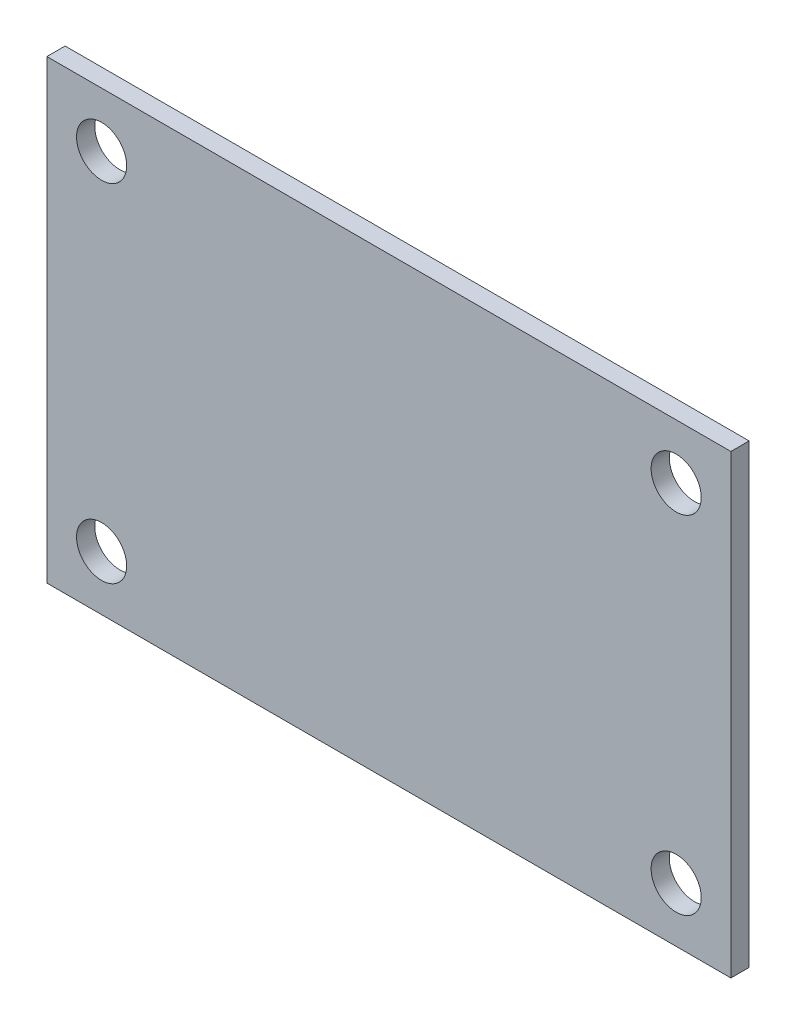
ISO-10303-21;
HEADER;
FILE_DESCRIPTION(('STEP AP214'),'2;1');
FILE_NAME('part.step','',(''),(''),'','','');
FILE_SCHEMA(('AUTOMOTIVE_DESIGN { 1 0 10303 214 1 1 1 1 }'));
ENDSEC;
DATA;
#1=APPLICATION_CONTEXT('core data for automotive mechanical design processes');
#2=APPLICATION_PROTOCOL_DEFINITION('international standard','automotive_design',2000,#1);
#3=PRODUCT_CONTEXT('',#1,'mechanical');
#4=PRODUCT('Part','Part','',(#3));
#5=PRODUCT_RELATED_PRODUCT_CATEGORY('part','',(#4));
#6=PRODUCT_DEFINITION_FORMATION('','',#4);
#7=PRODUCT_DEFINITION_CONTEXT('part definition',#1,'design');
#8=PRODUCT_DEFINITION('design','',#6,#7);
#9=PRODUCT_DEFINITION_SHAPE('','',#8);
#10=(LENGTH_UNIT() NAMED_UNIT(*) SI_UNIT(.MILLI.,.METRE.));
#11=(NAMED_UNIT(*) PLANE_ANGLE_UNIT() SI_UNIT($,.RADIAN.));
#12=(NAMED_UNIT(*) SI_UNIT($,.STERADIAN.) SOLID_ANGLE_UNIT());
#13=UNCERTAINTY_MEASURE_WITH_UNIT(LENGTH_MEASURE(1.E-05),#10,'distance_accuracy_value','');
#14=(GEOMETRIC_REPRESENTATION_CONTEXT(3) GLOBAL_UNCERTAINTY_ASSIGNED_CONTEXT((#13)) GLOBAL_UNIT_ASSIGNED_CONTEXT((#10,
#11,#12)) REPRESENTATION_CONTEXT('',''));
#15=CARTESIAN_POINT('',(0.,0.,0.));
#16=DIRECTION('',(0.,0.,1.));
#17=DIRECTION('',(1.,0.,0.));
#18=AXIS2_PLACEMENT_3D('',#15,#16,#17);
#19=CARTESIAN_POINT('',(-75.,49.9999999999999,4.));
#20=DIRECTION('',(1.,0.,0.));
#21=DIRECTION('',(0.,0.,-1.));
#22=AXIS2_PLACEMENT_3D('',#19,#20,#21);
#23=PLANE('',#22);
#24=DIRECTION('',(0.,-1.,0.));
#25=VECTOR('',#24,1.);
#26=CARTESIAN_POINT('',(-75.,49.9999999999999,0.));
#27=LINE('',#26,#25);
#28=CARTESIAN_POINT('',(-75.,49.9999999999999,0.));
#29=VERTEX_POINT('',#28);
#30=CARTESIAN_POINT('',(-75.,-50.0000000000001,0.));
#31=VERTEX_POINT('',#30);
#32=EDGE_CURVE('E102',#29,#31,#27,.T.);
#33=ORIENTED_EDGE('',*,*,#32,.T.);
#34=DIRECTION('',(0.,0.,-1.));
#35=VECTOR('',#34,1.);
#36=CARTESIAN_POINT('',(-75.,-50.0000000000001,4.));
#37=LINE('',#36,#35);
#38=CARTESIAN_POINT('',(-75.,-50.0000000000001,4.));
#39=VERTEX_POINT('',#38);
#40=EDGE_CURVE('E11',#39,#31,#37,.T.);
#41=ORIENTED_EDGE('',*,*,#40,.F.);
#42=DIRECTION('',(0.,-1.,0.));
#43=VECTOR('',#42,1.);
#44=CARTESIAN_POINT('',(-75.,49.9999999999999,4.));
#45=LINE('',#44,#43);
#46=CARTESIAN_POINT('',(-75.,49.9999999999999,4.));
#47=VERTEX_POINT('',#46);
#48=EDGE_CURVE('E90',#47,#39,#45,.T.);
#49=ORIENTED_EDGE('',*,*,#48,.F.);
#50=DIRECTION('',(0.,0.,-1.));
#51=VECTOR('',#50,1.);
#52=CARTESIAN_POINT('',(-75.,49.9999999999999,4.));
#53=LINE('',#52,#51);
#54=EDGE_CURVE('E98',#47,#29,#53,.T.);
#55=ORIENTED_EDGE('',*,*,#54,.T.);
#56=EDGE_LOOP('',(#33,#41,#49,#55));
#57=FACE_BOUND('',#56,.T.);
#58=ADVANCED_FACE('F39',(#57),#23,.F.);
#59=CARTESIAN_POINT('',(-75.,-50.0000000000001,4.));
#60=DIRECTION('',(0.,1.,0.));
#61=DIRECTION('',(0.,0.,1.));
#62=AXIS2_PLACEMENT_3D('',#59,#60,#61);
#63=PLANE('',#62);
#64=DIRECTION('',(1.,0.,0.));
#65=VECTOR('',#64,1.);
#66=CARTESIAN_POINT('',(-75.,-50.0000000000001,0.));
#67=LINE('',#66,#65);
#68=CARTESIAN_POINT('',(75.,-50.0000000000001,0.));
#69=VERTEX_POINT('',#68);
#70=EDGE_CURVE('E94',#31,#69,#67,.T.);
#71=ORIENTED_EDGE('',*,*,#70,.T.);
#72=DIRECTION('',(0.,0.,-1.));
#73=VECTOR('',#72,1.);
#74=CARTESIAN_POINT('',(75.,-50.0000000000001,4.));
#75=LINE('',#74,#73);
#76=CARTESIAN_POINT('',(75.,-50.0000000000001,4.));
#77=VERTEX_POINT('',#76);
#78=EDGE_CURVE('E47',#77,#69,#75,.T.);
#79=ORIENTED_EDGE('',*,*,#78,.F.);
#80=DIRECTION('',(1.,0.,0.));
#81=VECTOR('',#80,1.);
#82=CARTESIAN_POINT('',(-75.,-50.0000000000001,4.));
#83=LINE('',#82,#81);
#84=EDGE_CURVE('E85',#39,#77,#83,.T.);
#85=ORIENTED_EDGE('',*,*,#84,.F.);
#86=ORIENTED_EDGE('',*,*,#40,.T.);
#87=EDGE_LOOP('',(#71,#79,#85,#86));
#88=FACE_BOUND('',#87,.T.);
#89=ADVANCED_FACE('F93',(#88),#63,.F.);
#90=CARTESIAN_POINT('',(75.,49.9999999999999,4.));
#91=DIRECTION('',(-1.,0.,0.));
#92=DIRECTION('',(0.,0.,1.));
#93=AXIS2_PLACEMENT_3D('',#90,#91,#92);
#94=PLANE('',#93);
#95=DIRECTION('',(0.,1.,0.));
#96=VECTOR('',#95,1.);
#97=CARTESIAN_POINT('',(75.,49.9999999999999,0.));
#98=LINE('',#97,#96);
#99=CARTESIAN_POINT('',(75.,49.9999999999999,0.));
#100=VERTEX_POINT('',#99);
#101=EDGE_CURVE('E72',#69,#100,#98,.T.);
#102=ORIENTED_EDGE('',*,*,#101,.T.);
#103=DIRECTION('',(0.,0.,-1.));
#104=VECTOR('',#103,1.);
#105=CARTESIAN_POINT('',(75.,49.9999999999999,4.));
#106=LINE('',#105,#104);
#107=CARTESIAN_POINT('',(75.,49.9999999999999,4.));
#108=VERTEX_POINT('',#107);
#109=EDGE_CURVE('E95',#108,#100,#106,.T.);
#110=ORIENTED_EDGE('',*,*,#109,.F.);
#111=DIRECTION('',(0.,1.,0.));
#112=VECTOR('',#111,1.);
#113=CARTESIAN_POINT('',(75.,49.9999999999999,4.));
#114=LINE('',#113,#112);
#115=EDGE_CURVE('E88',#77,#108,#114,.T.);
#116=ORIENTED_EDGE('',*,*,#115,.F.);
#117=ORIENTED_EDGE('',*,*,#78,.T.);
#118=EDGE_LOOP('',(#102,#110,#116,#117));
#119=FACE_BOUND('',#118,.T.);
#120=ADVANCED_FACE('F96',(#119),#94,.F.);
#121=CARTESIAN_POINT('',(-75.,49.9999999999999,4.));
#122=DIRECTION('',(0.,-1.,0.));
#123=DIRECTION('',(0.,0.,-1.));
#124=AXIS2_PLACEMENT_3D('',#121,#122,#123);
#125=PLANE('',#124);
#126=DIRECTION('',(-1.,0.,0.));
#127=VECTOR('',#126,1.);
#128=CARTESIAN_POINT('',(-75.,49.9999999999999,0.));
#129=LINE('',#128,#127);
#130=EDGE_CURVE('E78',#100,#29,#129,.T.);
#131=ORIENTED_EDGE('',*,*,#130,.T.);
#132=ORIENTED_EDGE('',*,*,#54,.F.);
#133=DIRECTION('',(-1.,0.,0.));
#134=VECTOR('',#133,1.);
#135=CARTESIAN_POINT('',(-75.,49.9999999999999,4.));
#136=LINE('',#135,#134);
#137=EDGE_CURVE('E55',#108,#47,#136,.T.);
#138=ORIENTED_EDGE('',*,*,#137,.F.);
#139=ORIENTED_EDGE('',*,*,#109,.T.);
#140=EDGE_LOOP('',(#131,#132,#138,#139));
#141=FACE_BOUND('',#140,.T.);
#142=ADVANCED_FACE('F110',(#141),#125,.F.);
#143=CARTESIAN_POINT('',(0.,0.,4.));
#144=DIRECTION('',(0.,0.,1.));
#145=DIRECTION('',(1.,0.,0.));
#146=AXIS2_PLACEMENT_3D('',#143,#144,#145);
#147=PLANE('',#146);
#148=CARTESIAN_POINT('',(63.,-37.9999999999999,4.));
#149=DIRECTION('',(0.,0.,1.));
#150=DIRECTION('',(1.,0.,0.));
#151=AXIS2_PLACEMENT_3D('',#148,#149,#150);
#152=CIRCLE('',#151,5.49999999999999);
#153=CARTESIAN_POINT('',(68.5,-37.9999999999999,4.));
#154=VERTEX_POINT('',#153);
#155=EDGE_CURVE('E136',#154,#154,#152,.T.);
#156=ORIENTED_EDGE('',*,*,#155,.F.);
#157=EDGE_LOOP('',(#156));
#158=FACE_BOUND('',#157,.T.);
#159=CARTESIAN_POINT('',(-63.,-37.9999999999999,4.));
#160=DIRECTION('',(0.,0.,1.));
#161=DIRECTION('',(1.,0.,0.));
#162=AXIS2_PLACEMENT_3D('',#159,#160,#161);
#163=CIRCLE('',#162,5.5);
#164=CARTESIAN_POINT('',(-57.5,-37.9999999999999,4.));
#165=VERTEX_POINT('',#164);
#166=EDGE_CURVE('E130',#165,#165,#163,.T.);
#167=ORIENTED_EDGE('',*,*,#166,.F.);
#168=EDGE_LOOP('',(#167));
#169=FACE_BOUND('',#168,.T.);
#170=CARTESIAN_POINT('',(63.,37.9999999999999,4.));
#171=DIRECTION('',(0.,0.,1.));
#172=DIRECTION('',(1.,0.,0.));
#173=AXIS2_PLACEMENT_3D('',#170,#171,#172);
#174=CIRCLE('',#173,5.49999999999999);
#175=CARTESIAN_POINT('',(68.5,37.9999999999999,4.));
#176=VERTEX_POINT('',#175);
#177=EDGE_CURVE('E124',#176,#176,#174,.T.);
#178=ORIENTED_EDGE('',*,*,#177,.F.);
#179=EDGE_LOOP('',(#178));
#180=FACE_BOUND('',#179,.T.);
#181=CARTESIAN_POINT('',(-63.,37.9999999999999,4.));
#182=DIRECTION('',(0.,0.,1.));
#183=DIRECTION('',(1.,0.,0.));
#184=AXIS2_PLACEMENT_3D('',#181,#182,#183);
#185=CIRCLE('',#184,5.5);
#186=CARTESIAN_POINT('',(-57.5,37.9999999999999,4.));
#187=VERTEX_POINT('',#186);
#188=EDGE_CURVE('E118',#187,#187,#185,.T.);
#189=ORIENTED_EDGE('',*,*,#188,.F.);
#190=EDGE_LOOP('',(#189));
#191=FACE_BOUND('',#190,.T.);
#192=ORIENTED_EDGE('',*,*,#48,.T.);
#193=ORIENTED_EDGE('',*,*,#84,.T.);
#194=ORIENTED_EDGE('',*,*,#115,.T.);
#195=ORIENTED_EDGE('',*,*,#137,.T.);
#196=EDGE_LOOP('',(#192,#193,#194,#195));
#197=FACE_BOUND('',#196,.T.);
#198=ADVANCED_FACE('F86',(#158,#169,#180,#191,#197),#147,.T.);
#199=CARTESIAN_POINT('',(0.,0.,0.));
#200=DIRECTION('',(0.,0.,1.));
#201=DIRECTION('',(1.,0.,0.));
#202=AXIS2_PLACEMENT_3D('',#199,#200,#201);
#203=PLANE('',#202);
#204=CARTESIAN_POINT('',(63.,-37.9999999999999,0.));
#205=DIRECTION('',(0.,0.,1.));
#206=DIRECTION('',(1.,0.,0.));
#207=AXIS2_PLACEMENT_3D('',#204,#205,#206);
#208=CIRCLE('',#207,5.50000000000001);
#209=CARTESIAN_POINT('',(68.5,-37.9999999999999,0.));
#210=VERTEX_POINT('',#209);
#211=EDGE_CURVE('E133',#210,#210,#208,.T.);
#212=ORIENTED_EDGE('',*,*,#211,.T.);
#213=EDGE_LOOP('',(#212));
#214=FACE_BOUND('',#213,.T.);
#215=CARTESIAN_POINT('',(-63.,-37.9999999999999,0.));
#216=DIRECTION('',(0.,0.,1.));
#217=DIRECTION('',(1.,0.,0.));
#218=AXIS2_PLACEMENT_3D('',#215,#216,#217);
#219=CIRCLE('',#218,5.5);
#220=CARTESIAN_POINT('',(-57.5,-37.9999999999999,0.));
#221=VERTEX_POINT('',#220);
#222=EDGE_CURVE('E127',#221,#221,#219,.T.);
#223=ORIENTED_EDGE('',*,*,#222,.T.);
#224=EDGE_LOOP('',(#223));
#225=FACE_BOUND('',#224,.T.);
#226=CARTESIAN_POINT('',(63.,37.9999999999999,0.));
#227=DIRECTION('',(0.,0.,1.));
#228=DIRECTION('',(1.,0.,0.));
#229=AXIS2_PLACEMENT_3D('',#226,#227,#228);
#230=CIRCLE('',#229,5.50000000000001);
#231=CARTESIAN_POINT('',(68.5,37.9999999999999,0.));
#232=VERTEX_POINT('',#231);
#233=EDGE_CURVE('E121',#232,#232,#230,.T.);
#234=ORIENTED_EDGE('',*,*,#233,.T.);
#235=EDGE_LOOP('',(#234));
#236=FACE_BOUND('',#235,.T.);
#237=CARTESIAN_POINT('',(-63.,37.9999999999999,0.));
#238=DIRECTION('',(0.,0.,1.));
#239=DIRECTION('',(1.,0.,0.));
#240=AXIS2_PLACEMENT_3D('',#237,#238,#239);
#241=CIRCLE('',#240,5.5);
#242=CARTESIAN_POINT('',(-57.5,37.9999999999999,0.));
#243=VERTEX_POINT('',#242);
#244=EDGE_CURVE('E105',#243,#243,#241,.T.);
#245=ORIENTED_EDGE('',*,*,#244,.T.);
#246=EDGE_LOOP('',(#245));
#247=FACE_BOUND('',#246,.T.);
#248=ORIENTED_EDGE('',*,*,#32,.F.);
#249=ORIENTED_EDGE('',*,*,#130,.F.);
#250=ORIENTED_EDGE('',*,*,#101,.F.);
#251=ORIENTED_EDGE('',*,*,#70,.F.);
#252=EDGE_LOOP('',(#248,#249,#250,#251));
#253=FACE_BOUND('',#252,.T.);
#254=ADVANCED_FACE('F113',(#214,#225,#236,#247,#253),#203,.F.);
#255=CARTESIAN_POINT('',(-63.,37.9999999999999,4.));
#256=DIRECTION('',(0.,0.,1.));
#257=DIRECTION('',(1.,0.,0.));
#258=AXIS2_PLACEMENT_3D('',#255,#256,#257);
#259=CYLINDRICAL_SURFACE('',#258,5.5);
#260=ORIENTED_EDGE('',*,*,#244,.F.);
#261=EDGE_LOOP('',(#260));
#262=FACE_BOUND('',#261,.T.);
#263=ORIENTED_EDGE('',*,*,#188,.T.);
#264=EDGE_LOOP('',(#263));
#265=FACE_BOUND('',#264,.T.);
#266=ADVANCED_FACE('F151',(#262,#265),#259,.F.);
#267=CARTESIAN_POINT('',(63.,37.9999999999999,4.));
#268=DIRECTION('',(0.,0.,1.));
#269=DIRECTION('',(1.,0.,0.));
#270=AXIS2_PLACEMENT_3D('',#267,#268,#269);
#271=CYLINDRICAL_SURFACE('',#270,5.5);
#272=ORIENTED_EDGE('',*,*,#233,.F.);
#273=EDGE_LOOP('',(#272));
#274=FACE_BOUND('',#273,.T.);
#275=ORIENTED_EDGE('',*,*,#177,.T.);
#276=EDGE_LOOP('',(#275));
#277=FACE_BOUND('',#276,.T.);
#278=ADVANCED_FACE('F153',(#274,#277),#271,.F.);
#279=CARTESIAN_POINT('',(-63.,-37.9999999999999,4.));
#280=DIRECTION('',(0.,0.,1.));
#281=DIRECTION('',(1.,0.,0.));
#282=AXIS2_PLACEMENT_3D('',#279,#280,#281);
#283=CYLINDRICAL_SURFACE('',#282,5.5);
#284=ORIENTED_EDGE('',*,*,#222,.F.);
#285=EDGE_LOOP('',(#284));
#286=FACE_BOUND('',#285,.T.);
#287=ORIENTED_EDGE('',*,*,#166,.T.);
#288=EDGE_LOOP('',(#287));
#289=FACE_BOUND('',#288,.T.);
#290=ADVANCED_FACE('F160',(#286,#289),#283,.F.);
#291=CARTESIAN_POINT('',(63.,-37.9999999999999,4.));
#292=DIRECTION('',(0.,0.,1.));
#293=DIRECTION('',(1.,0.,0.));
#294=AXIS2_PLACEMENT_3D('',#291,#292,#293);
#295=CYLINDRICAL_SURFACE('',#294,5.5);
#296=ORIENTED_EDGE('',*,*,#211,.F.);
#297=EDGE_LOOP('',(#296));
#298=FACE_BOUND('',#297,.T.);
#299=ORIENTED_EDGE('',*,*,#155,.T.);
#300=EDGE_LOOP('',(#299));
#301=FACE_BOUND('',#300,.T.);
#302=ADVANCED_FACE('F140',(#298,#301),#295,.F.);
#303=CLOSED_SHELL('',(#58,#89,#120,#142,#198,#254,#266,#278,#290,#302));
#304=MANIFOLD_SOLID_BREP('B2',#303);
#305=ADVANCED_BREP_SHAPE_REPRESENTATION('',(#18,#304),#14);
#306=SHAPE_DEFINITION_REPRESENTATION(#9,#305);
ENDSEC;
END-ISO-10303-21;
